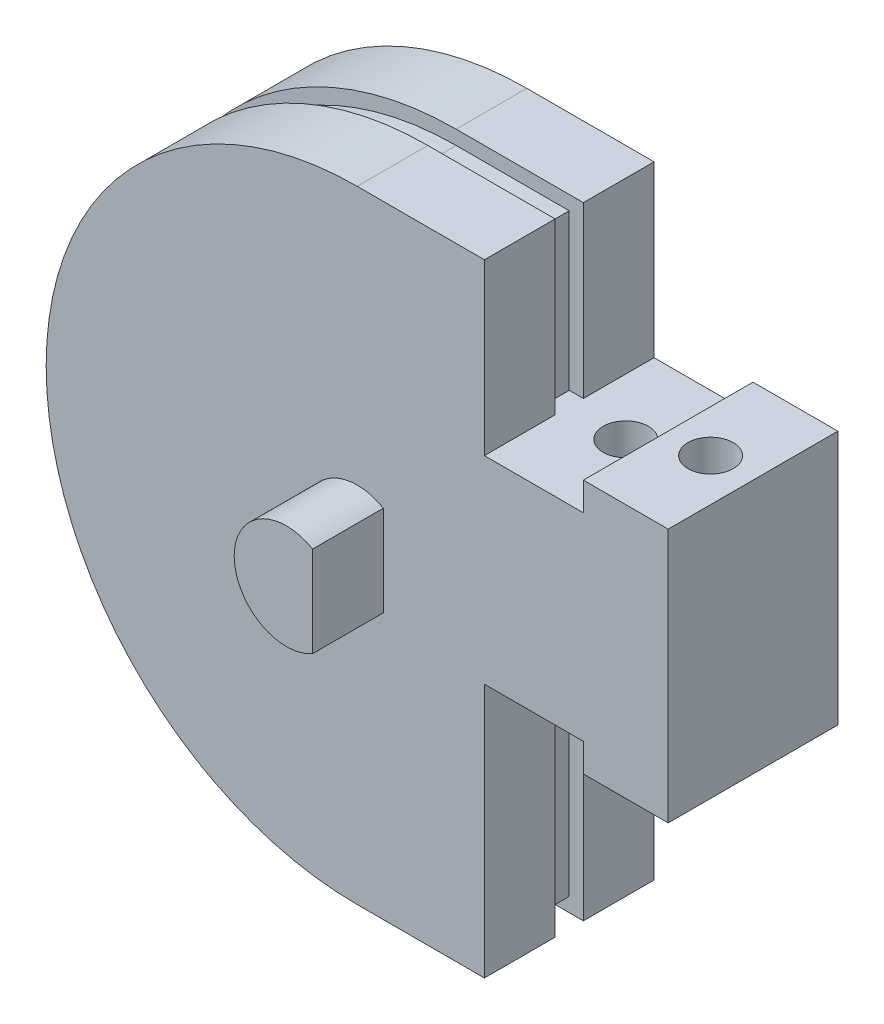
ISO-10303-21;
HEADER;
FILE_DESCRIPTION(('STEP AP214'),'2;1');
FILE_NAME('part.step','',(''),(''),'','','');
FILE_SCHEMA(('AUTOMOTIVE_DESIGN { 1 0 10303 214 1 1 1 1 }'));
ENDSEC;
DATA;
#1=APPLICATION_CONTEXT('core data for automotive mechanical design processes');
#2=APPLICATION_PROTOCOL_DEFINITION('international standard','automotive_design',2000,#1);
#3=PRODUCT_CONTEXT('',#1,'mechanical');
#4=PRODUCT('Part','Part','',(#3));
#5=PRODUCT_RELATED_PRODUCT_CATEGORY('part','',(#4));
#6=PRODUCT_DEFINITION_FORMATION('','',#4);
#7=PRODUCT_DEFINITION_CONTEXT('part definition',#1,'design');
#8=PRODUCT_DEFINITION('design','',#6,#7);
#9=PRODUCT_DEFINITION_SHAPE('','',#8);
#10=(LENGTH_UNIT() NAMED_UNIT(*) SI_UNIT(.MILLI.,.METRE.));
#11=(NAMED_UNIT(*) PLANE_ANGLE_UNIT() SI_UNIT($,.RADIAN.));
#12=(NAMED_UNIT(*) SI_UNIT($,.STERADIAN.) SOLID_ANGLE_UNIT());
#13=UNCERTAINTY_MEASURE_WITH_UNIT(LENGTH_MEASURE(1.E-05),#10,'distance_accuracy_value','');
#14=(GEOMETRIC_REPRESENTATION_CONTEXT(3) GLOBAL_UNCERTAINTY_ASSIGNED_CONTEXT((#13)) GLOBAL_UNIT_ASSIGNED_CONTEXT((#10,
#11,#12)) REPRESENTATION_CONTEXT('',''));
#15=CARTESIAN_POINT('',(0.,0.,0.));
#16=DIRECTION('',(0.,0.,1.));
#17=DIRECTION('',(1.,0.,0.));
#18=AXIS2_PLACEMENT_3D('',#15,#16,#17);
#19=CARTESIAN_POINT('',(0.,0.,0.));
#20=DIRECTION('',(0.,0.,1.));
#21=DIRECTION('',(1.,0.,0.));
#22=AXIS2_PLACEMENT_3D('',#19,#20,#21);
#23=PLANE('',#22);
#24=DIRECTION('',(-1.,0.,0.));
#25=VECTOR('',#24,1.);
#26=CARTESIAN_POINT('',(11.,6.,0.));
#27=LINE('',#26,#25);
#28=CARTESIAN_POINT('',(11.,6.,0.));
#29=VERTEX_POINT('',#28);
#30=CARTESIAN_POINT('',(8.,6.,0.));
#31=VERTEX_POINT('',#30);
#32=EDGE_CURVE('E309',#29,#31,#27,.T.);
#33=ORIENTED_EDGE('',*,*,#32,.F.);
#34=DIRECTION('',(0.,1.,0.));
#35=VECTOR('',#34,1.);
#36=CARTESIAN_POINT('',(11.,6.,0.));
#37=LINE('',#36,#35);
#38=CARTESIAN_POINT('',(11.,-3.,0.));
#39=VERTEX_POINT('',#38);
#40=EDGE_CURVE('E314',#39,#29,#37,.T.);
#41=ORIENTED_EDGE('',*,*,#40,.F.);
#42=DIRECTION('',(1.,0.,0.));
#43=VECTOR('',#42,1.);
#44=CARTESIAN_POINT('',(11.,-3.,0.));
#45=LINE('',#44,#43);
#46=CARTESIAN_POINT('',(8.,-3.,0.));
#47=VERTEX_POINT('',#46);
#48=EDGE_CURVE('E363',#47,#39,#45,.T.);
#49=ORIENTED_EDGE('',*,*,#48,.F.);
#50=DIRECTION('',(0.,-1.,0.));
#51=VECTOR('',#50,1.);
#52=CARTESIAN_POINT('',(8.,-3.,0.));
#53=LINE('',#52,#51);
#54=CARTESIAN_POINT('',(8.,-2.,0.));
#55=VERTEX_POINT('',#54);
#56=EDGE_CURVE('E361',#55,#47,#53,.T.);
#57=ORIENTED_EDGE('',*,*,#56,.F.);
#58=DIRECTION('',(1.,0.,0.));
#59=VECTOR('',#58,1.);
#60=CARTESIAN_POINT('',(8.,-2.,0.));
#61=LINE('',#60,#59);
#62=CARTESIAN_POINT('',(4.5,-2.,0.));
#63=VERTEX_POINT('',#62);
#64=EDGE_CURVE('E359',#63,#55,#61,.T.);
#65=ORIENTED_EDGE('',*,*,#64,.F.);
#66=DIRECTION('',(0.,1.,0.));
#67=VECTOR('',#66,1.);
#68=CARTESIAN_POINT('',(4.5,-2.,0.));
#69=LINE('',#68,#67);
#70=CARTESIAN_POINT('',(4.5,-11.,0.));
#71=VERTEX_POINT('',#70);
#72=EDGE_CURVE('E356',#71,#63,#69,.T.);
#73=ORIENTED_EDGE('',*,*,#72,.F.);
#74=DIRECTION('',(1.,0.,0.));
#75=VECTOR('',#74,1.);
#76=CARTESIAN_POINT('',(0.,-11.,0.));
#77=LINE('',#76,#75);
#78=CARTESIAN_POINT('',(0.,-11.,0.));
#79=VERTEX_POINT('',#78);
#80=EDGE_CURVE('E353',#79,#71,#77,.T.);
#81=ORIENTED_EDGE('',*,*,#80,.F.);
#82=CARTESIAN_POINT('',(0.,0.,0.));
#83=DIRECTION('',(0.,0.,1.));
#84=DIRECTION('',(1.,0.,0.));
#85=AXIS2_PLACEMENT_3D('',#82,#83,#84);
#86=CIRCLE('',#85,11.);
#87=CARTESIAN_POINT('',(0.,11.,0.));
#88=VERTEX_POINT('',#87);
#89=EDGE_CURVE('E350',#88,#79,#86,.T.);
#90=ORIENTED_EDGE('',*,*,#89,.F.);
#91=DIRECTION('',(-1.,0.,0.));
#92=VECTOR('',#91,1.);
#93=CARTESIAN_POINT('',(0.,11.,0.));
#94=LINE('',#93,#92);
#95=CARTESIAN_POINT('',(4.5,11.,0.));
#96=VERTEX_POINT('',#95);
#97=EDGE_CURVE('E347',#96,#88,#94,.T.);
#98=ORIENTED_EDGE('',*,*,#97,.F.);
#99=DIRECTION('',(0.,1.,0.));
#100=VECTOR('',#99,1.);
#101=CARTESIAN_POINT('',(4.5,5.,0.));
#102=LINE('',#101,#100);
#103=CARTESIAN_POINT('',(4.5,5.,0.));
#104=VERTEX_POINT('',#103);
#105=EDGE_CURVE('E344',#104,#96,#102,.T.);
#106=ORIENTED_EDGE('',*,*,#105,.F.);
#107=DIRECTION('',(-1.,0.,0.));
#108=VECTOR('',#107,1.);
#109=CARTESIAN_POINT('',(8.,5.,0.));
#110=LINE('',#109,#108);
#111=CARTESIAN_POINT('',(8.,5.,0.));
#112=VERTEX_POINT('',#111);
#113=EDGE_CURVE('E341',#112,#104,#110,.T.);
#114=ORIENTED_EDGE('',*,*,#113,.F.);
#115=DIRECTION('',(0.,-1.,0.));
#116=VECTOR('',#115,1.);
#117=CARTESIAN_POINT('',(8.,6.,0.));
#118=LINE('',#117,#116);
#119=EDGE_CURVE('E339',#31,#112,#118,.T.);
#120=ORIENTED_EDGE('',*,*,#119,.F.);
#121=EDGE_LOOP('',(#33,#41,#49,#57,#65,#73,#81,#90,#98,#106,#114,#120));
#122=FACE_BOUND('',#121,.T.);
#123=CARTESIAN_POINT('',(0.,0.,0.));
#124=DIRECTION('',(0.,0.,1.));
#125=DIRECTION('',(1.,0.,0.));
#126=AXIS2_PLACEMENT_3D('',#123,#124,#125);
#127=CIRCLE('',#126,2.75);
#128=CARTESIAN_POINT('',(2.75,0.,0.));
#129=VERTEX_POINT('',#128);
#130=EDGE_CURVE('E801',#129,#129,#127,.T.);
#131=ORIENTED_EDGE('',*,*,#130,.T.);
#132=EDGE_LOOP('',(#131));
#133=FACE_BOUND('',#132,.T.);
#134=ADVANCED_FACE('F35',(#122,#133),#23,.F.);
#135=CARTESIAN_POINT('',(0.,0.,6.));
#136=DIRECTION('',(0.,0.,1.));
#137=DIRECTION('',(1.,0.,0.));
#138=AXIS2_PLACEMENT_3D('',#135,#136,#137);
#139=PLANE('',#138);
#140=DIRECTION('',(-1.,0.,0.));
#141=VECTOR('',#140,1.);
#142=CARTESIAN_POINT('',(11.,6.,6.));
#143=LINE('',#142,#141);
#144=CARTESIAN_POINT('',(11.,6.,6.));
#145=VERTEX_POINT('',#144);
#146=CARTESIAN_POINT('',(8.,6.,6.));
#147=VERTEX_POINT('',#146);
#148=EDGE_CURVE('E310',#145,#147,#143,.T.);
#149=ORIENTED_EDGE('',*,*,#148,.T.);
#150=DIRECTION('',(0.,-1.,0.));
#151=VECTOR('',#150,1.);
#152=CARTESIAN_POINT('',(8.,6.,6.));
#153=LINE('',#152,#151);
#154=CARTESIAN_POINT('',(8.,5.,6.));
#155=VERTEX_POINT('',#154);
#156=EDGE_CURVE('E313',#147,#155,#153,.T.);
#157=ORIENTED_EDGE('',*,*,#156,.T.);
#158=DIRECTION('',(-1.,0.,0.));
#159=VECTOR('',#158,1.);
#160=CARTESIAN_POINT('',(8.,5.,6.));
#161=LINE('',#160,#159);
#162=CARTESIAN_POINT('',(4.5,5.,6.));
#163=VERTEX_POINT('',#162);
#164=EDGE_CURVE('E316',#155,#163,#161,.T.);
#165=ORIENTED_EDGE('',*,*,#164,.T.);
#166=DIRECTION('',(0.,1.,0.));
#167=VECTOR('',#166,1.);
#168=CARTESIAN_POINT('',(4.5,5.,6.));
#169=LINE('',#168,#167);
#170=CARTESIAN_POINT('',(4.5,11.,6.));
#171=VERTEX_POINT('',#170);
#172=EDGE_CURVE('E318',#163,#171,#169,.T.);
#173=ORIENTED_EDGE('',*,*,#172,.T.);
#174=DIRECTION('',(-1.,0.,0.));
#175=VECTOR('',#174,1.);
#176=CARTESIAN_POINT('',(0.,11.,6.));
#177=LINE('',#176,#175);
#178=CARTESIAN_POINT('',(0.,11.,6.));
#179=VERTEX_POINT('',#178);
#180=EDGE_CURVE('E320',#171,#179,#177,.T.);
#181=ORIENTED_EDGE('',*,*,#180,.T.);
#182=CARTESIAN_POINT('',(0.,0.,6.));
#183=DIRECTION('',(0.,0.,1.));
#184=DIRECTION('',(1.,0.,0.));
#185=AXIS2_PLACEMENT_3D('',#182,#183,#184);
#186=CIRCLE('',#185,11.);
#187=CARTESIAN_POINT('',(0.,-11.,6.));
#188=VERTEX_POINT('',#187);
#189=EDGE_CURVE('E322',#179,#188,#186,.T.);
#190=ORIENTED_EDGE('',*,*,#189,.T.);
#191=DIRECTION('',(1.,0.,0.));
#192=VECTOR('',#191,1.);
#193=CARTESIAN_POINT('',(0.,-11.,6.));
#194=LINE('',#193,#192);
#195=CARTESIAN_POINT('',(4.5,-11.,6.));
#196=VERTEX_POINT('',#195);
#197=EDGE_CURVE('E324',#188,#196,#194,.T.);
#198=ORIENTED_EDGE('',*,*,#197,.T.);
#199=DIRECTION('',(0.,1.,0.));
#200=VECTOR('',#199,1.);
#201=CARTESIAN_POINT('',(4.5,-2.,6.));
#202=LINE('',#201,#200);
#203=CARTESIAN_POINT('',(4.5,-2.,6.));
#204=VERTEX_POINT('',#203);
#205=EDGE_CURVE('E326',#196,#204,#202,.T.);
#206=ORIENTED_EDGE('',*,*,#205,.T.);
#207=DIRECTION('',(1.,0.,0.));
#208=VECTOR('',#207,1.);
#209=CARTESIAN_POINT('',(8.,-2.,6.));
#210=LINE('',#209,#208);
#211=CARTESIAN_POINT('',(8.,-2.,6.));
#212=VERTEX_POINT('',#211);
#213=EDGE_CURVE('E328',#204,#212,#210,.T.);
#214=ORIENTED_EDGE('',*,*,#213,.T.);
#215=DIRECTION('',(0.,-1.,0.));
#216=VECTOR('',#215,1.);
#217=CARTESIAN_POINT('',(8.,-3.,6.));
#218=LINE('',#217,#216);
#219=CARTESIAN_POINT('',(8.,-3.,6.));
#220=VERTEX_POINT('',#219);
#221=EDGE_CURVE('E330',#212,#220,#218,.T.);
#222=ORIENTED_EDGE('',*,*,#221,.T.);
#223=DIRECTION('',(1.,0.,0.));
#224=VECTOR('',#223,1.);
#225=CARTESIAN_POINT('',(11.,-3.,6.));
#226=LINE('',#225,#224);
#227=CARTESIAN_POINT('',(11.,-3.,6.));
#228=VERTEX_POINT('',#227);
#229=EDGE_CURVE('E332',#220,#228,#226,.T.);
#230=ORIENTED_EDGE('',*,*,#229,.T.);
#231=DIRECTION('',(0.,1.,0.));
#232=VECTOR('',#231,1.);
#233=CARTESIAN_POINT('',(11.,6.,6.));
#234=LINE('',#233,#232);
#235=EDGE_CURVE('E334',#228,#145,#234,.T.);
#236=ORIENTED_EDGE('',*,*,#235,.T.);
#237=EDGE_LOOP('',(#149,#157,#165,#173,#181,#190,#198,#206,#214,#222,#230,#236));
#238=FACE_BOUND('',#237,.T.);
#239=DIRECTION('',(0.,-1.,0.));
#240=VECTOR('',#239,1.);
#241=CARTESIAN_POINT('',(0.924999999999981,0.,6.));
#242=LINE('',#241,#240);
#243=CARTESIAN_POINT('',(0.924999999999981,1.6021469970012,6.));
#244=VERTEX_POINT('',#243);
#245=CARTESIAN_POINT('',(0.924999999999981,-1.6021469970012,6.));
#246=VERTEX_POINT('',#245);
#247=EDGE_CURVE('E51',#244,#246,#242,.T.);
#248=ORIENTED_EDGE('',*,*,#247,.T.);
#249=CARTESIAN_POINT('',(0.,0.,6.));
#250=DIRECTION('',(0.,0.,1.));
#251=DIRECTION('',(1.,0.,0.));
#252=AXIS2_PLACEMENT_3D('',#249,#250,#251);
#253=CIRCLE('',#252,1.84999999999998);
#254=EDGE_CURVE('E221',#244,#246,#253,.T.);
#255=ORIENTED_EDGE('',*,*,#254,.F.);
#256=EDGE_LOOP('',(#248,#255));
#257=FACE_BOUND('',#256,.T.);
#258=ADVANCED_FACE('F492',(#238,#257),#139,.T.);
#259=CARTESIAN_POINT('',(4.5,5.,6.));
#260=DIRECTION('',(-1.,0.,0.));
#261=DIRECTION('',(0.,0.,1.));
#262=AXIS2_PLACEMENT_3D('',#259,#260,#261);
#263=PLANE('',#262);
#264=DIRECTION('',(0.,1.,0.));
#265=VECTOR('',#264,1.);
#266=CARTESIAN_POINT('',(4.5,11.,2.5));
#267=LINE('',#266,#265);
#268=CARTESIAN_POINT('',(4.5,5.,2.5));
#269=VERTEX_POINT('',#268);
#270=CARTESIAN_POINT('',(4.5,11.,2.5));
#271=VERTEX_POINT('',#270);
#272=EDGE_CURVE('E283',#269,#271,#267,.T.);
#273=ORIENTED_EDGE('',*,*,#272,.F.);
#274=DIRECTION('',(0.,0.,-1.));
#275=VECTOR('',#274,1.);
#276=CARTESIAN_POINT('',(4.5,5.,6.));
#277=LINE('',#276,#275);
#278=EDGE_CURVE('E397',#269,#104,#277,.T.);
#279=ORIENTED_EDGE('',*,*,#278,.T.);
#280=ORIENTED_EDGE('',*,*,#105,.T.);
#281=DIRECTION('',(0.,0.,-1.));
#282=VECTOR('',#281,1.);
#283=CARTESIAN_POINT('',(4.5,11.,6.));
#284=LINE('',#283,#282);
#285=EDGE_CURVE('E393',#271,#96,#284,.T.);
#286=ORIENTED_EDGE('',*,*,#285,.F.);
#287=EDGE_LOOP('',(#273,#279,#280,#286));
#288=FACE_BOUND('',#287,.T.);
#289=ADVANCED_FACE('F435',(#288),#263,.F.);
#290=CARTESIAN_POINT('',(0.,11.,6.));
#291=DIRECTION('',(0.,-1.,0.));
#292=DIRECTION('',(0.,0.,-1.));
#293=AXIS2_PLACEMENT_3D('',#290,#291,#292);
#294=PLANE('',#293);
#295=DIRECTION('',(-1.,0.,0.));
#296=VECTOR('',#295,1.);
#297=CARTESIAN_POINT('',(0.,11.,2.5));
#298=LINE('',#297,#296);
#299=CARTESIAN_POINT('',(0.,11.,2.5));
#300=VERTEX_POINT('',#299);
#301=EDGE_CURVE('E238',#271,#300,#298,.T.);
#302=ORIENTED_EDGE('',*,*,#301,.F.);
#303=ORIENTED_EDGE('',*,*,#285,.T.);
#304=ORIENTED_EDGE('',*,*,#97,.T.);
#305=DIRECTION('',(0.,0.,-1.));
#306=VECTOR('',#305,1.);
#307=CARTESIAN_POINT('',(0.,11.,6.));
#308=LINE('',#307,#306);
#309=EDGE_CURVE('E389',#300,#88,#308,.T.);
#310=ORIENTED_EDGE('',*,*,#309,.F.);
#311=EDGE_LOOP('',(#302,#303,#304,#310));
#312=FACE_BOUND('',#311,.T.);
#313=ADVANCED_FACE('F442',(#312),#294,.F.);
#314=CARTESIAN_POINT('',(0.,0.,6.));
#315=DIRECTION('',(0.,0.,-1.));
#316=DIRECTION('',(-1.,0.,0.));
#317=AXIS2_PLACEMENT_3D('',#314,#315,#316);
#318=CYLINDRICAL_SURFACE('',#317,11.);
#319=CARTESIAN_POINT('',(0.,0.,2.5));
#320=DIRECTION('',(0.,0.,1.));
#321=DIRECTION('',(1.,0.,0.));
#322=AXIS2_PLACEMENT_3D('',#319,#320,#321);
#323=CIRCLE('',#322,11.);
#324=CARTESIAN_POINT('',(0.,-11.,2.5));
#325=VERTEX_POINT('',#324);
#326=EDGE_CURVE('E223',#300,#325,#323,.T.);
#327=ORIENTED_EDGE('',*,*,#326,.F.);
#328=ORIENTED_EDGE('',*,*,#309,.T.);
#329=ORIENTED_EDGE('',*,*,#89,.T.);
#330=DIRECTION('',(0.,0.,-1.));
#331=VECTOR('',#330,1.);
#332=CARTESIAN_POINT('',(0.,-11.,6.));
#333=LINE('',#332,#331);
#334=EDGE_CURVE('E385',#325,#79,#333,.T.);
#335=ORIENTED_EDGE('',*,*,#334,.F.);
#336=EDGE_LOOP('',(#327,#328,#329,#335));
#337=FACE_BOUND('',#336,.T.);
#338=ADVANCED_FACE('F444',(#337),#318,.T.);
#339=CARTESIAN_POINT('',(0.,-11.,6.));
#340=DIRECTION('',(0.,1.,0.));
#341=DIRECTION('',(0.,0.,1.));
#342=AXIS2_PLACEMENT_3D('',#339,#340,#341);
#343=PLANE('',#342);
#344=DIRECTION('',(1.,0.,0.));
#345=VECTOR('',#344,1.);
#346=CARTESIAN_POINT('',(0.,-11.,2.5));
#347=LINE('',#346,#345);
#348=CARTESIAN_POINT('',(4.5,-11.,2.5));
#349=VERTEX_POINT('',#348);
#350=EDGE_CURVE('E266',#325,#349,#347,.T.);
#351=ORIENTED_EDGE('',*,*,#350,.F.);
#352=ORIENTED_EDGE('',*,*,#334,.T.);
#353=ORIENTED_EDGE('',*,*,#80,.T.);
#354=DIRECTION('',(0.,0.,-1.));
#355=VECTOR('',#354,1.);
#356=CARTESIAN_POINT('',(4.5,-11.,6.));
#357=LINE('',#356,#355);
#358=EDGE_CURVE('E381',#349,#71,#357,.T.);
#359=ORIENTED_EDGE('',*,*,#358,.F.);
#360=EDGE_LOOP('',(#351,#352,#353,#359));
#361=FACE_BOUND('',#360,.T.);
#362=ADVANCED_FACE('F451',(#361),#343,.F.);
#363=CARTESIAN_POINT('',(4.5,-2.,6.));
#364=DIRECTION('',(-1.,0.,0.));
#365=DIRECTION('',(0.,0.,1.));
#366=AXIS2_PLACEMENT_3D('',#363,#364,#365);
#367=PLANE('',#366);
#368=DIRECTION('',(0.,1.,0.));
#369=VECTOR('',#368,1.);
#370=CARTESIAN_POINT('',(4.5,-11.,2.5));
#371=LINE('',#370,#369);
#372=CARTESIAN_POINT('',(4.5,-2.,2.5));
#373=VERTEX_POINT('',#372);
#374=EDGE_CURVE('E268',#349,#373,#371,.T.);
#375=ORIENTED_EDGE('',*,*,#374,.F.);
#376=ORIENTED_EDGE('',*,*,#358,.T.);
#377=ORIENTED_EDGE('',*,*,#72,.T.);
#378=DIRECTION('',(0.,0.,-1.));
#379=VECTOR('',#378,1.);
#380=CARTESIAN_POINT('',(4.5,-2.,6.));
#381=LINE('',#380,#379);
#382=EDGE_CURVE('E377',#373,#63,#381,.T.);
#383=ORIENTED_EDGE('',*,*,#382,.F.);
#384=EDGE_LOOP('',(#375,#376,#377,#383));
#385=FACE_BOUND('',#384,.T.);
#386=ADVANCED_FACE('F454',(#385),#367,.F.);
#387=CARTESIAN_POINT('',(11.,6.,6.));
#388=DIRECTION('',(0.,-1.,0.));
#389=DIRECTION('',(0.,0.,-1.));
#390=AXIS2_PLACEMENT_3D('',#387,#388,#389);
#391=PLANE('',#390);
#392=CARTESIAN_POINT('',(9.5,6.,3.));
#393=DIRECTION('',(0.,-1.,0.));
#394=DIRECTION('',(0.,0.,-1.));
#395=AXIS2_PLACEMENT_3D('',#392,#393,#394);
#396=CIRCLE('',#395,0.799999999999999);
#397=CARTESIAN_POINT('',(9.5,6.,2.2));
#398=VERTEX_POINT('',#397);
#399=EDGE_CURVE('E302',#398,#398,#396,.T.);
#400=ORIENTED_EDGE('',*,*,#399,.T.);
#401=EDGE_LOOP('',(#400));
#402=FACE_BOUND('',#401,.T.);
#403=ORIENTED_EDGE('',*,*,#32,.T.);
#404=DIRECTION('',(0.,0.,-1.));
#405=VECTOR('',#404,1.);
#406=CARTESIAN_POINT('',(8.,6.,6.));
#407=LINE('',#406,#405);
#408=EDGE_CURVE('E11',#147,#31,#407,.T.);
#409=ORIENTED_EDGE('',*,*,#408,.F.);
#410=ORIENTED_EDGE('',*,*,#148,.F.);
#411=DIRECTION('',(0.,0.,-1.));
#412=VECTOR('',#411,1.);
#413=CARTESIAN_POINT('',(11.,6.,6.));
#414=LINE('',#413,#412);
#415=EDGE_CURVE('E336',#145,#29,#414,.T.);
#416=ORIENTED_EDGE('',*,*,#415,.T.);
#417=EDGE_LOOP('',(#403,#409,#410,#416));
#418=FACE_BOUND('',#417,.T.);
#419=ADVANCED_FACE('F37',(#402,#418),#391,.F.);
#420=CARTESIAN_POINT('',(8.,6.,6.));
#421=DIRECTION('',(1.,0.,0.));
#422=DIRECTION('',(0.,0.,-1.));
#423=AXIS2_PLACEMENT_3D('',#420,#421,#422);
#424=PLANE('',#423);
#425=ORIENTED_EDGE('',*,*,#119,.T.);
#426=DIRECTION('',(0.,0.,-1.));
#427=VECTOR('',#426,1.);
#428=CARTESIAN_POINT('',(8.,5.,6.));
#429=LINE('',#428,#427);
#430=EDGE_CURVE('E44',#155,#112,#429,.T.);
#431=ORIENTED_EDGE('',*,*,#430,.F.);
#432=ORIENTED_EDGE('',*,*,#156,.F.);
#433=ORIENTED_EDGE('',*,*,#408,.T.);
#434=EDGE_LOOP('',(#425,#431,#432,#433));
#435=FACE_BOUND('',#434,.T.);
#436=ADVANCED_FACE('F419',(#435),#424,.F.);
#437=CARTESIAN_POINT('',(8.,5.,6.));
#438=DIRECTION('',(0.,-1.,0.));
#439=DIRECTION('',(0.,0.,-1.));
#440=AXIS2_PLACEMENT_3D('',#437,#438,#439);
#441=PLANE('',#440);
#442=CARTESIAN_POINT('',(6.5,5.,3.));
#443=DIRECTION('',(0.,-1.,0.));
#444=DIRECTION('',(0.,0.,-1.));
#445=AXIS2_PLACEMENT_3D('',#442,#443,#444);
#446=CIRCLE('',#445,0.8);
#447=CARTESIAN_POINT('',(6.5,5.,2.2));
#448=VERTEX_POINT('',#447);
#449=EDGE_CURVE('E306',#448,#448,#446,.T.);
#450=ORIENTED_EDGE('',*,*,#449,.T.);
#451=EDGE_LOOP('',(#450));
#452=FACE_BOUND('',#451,.T.);
#453=ORIENTED_EDGE('',*,*,#113,.T.);
#454=ORIENTED_EDGE('',*,*,#278,.F.);
#455=DIRECTION('',(1.,0.,0.));
#456=VECTOR('',#455,1.);
#457=CARTESIAN_POINT('',(4.5,5.,2.5));
#458=LINE('',#457,#456);
#459=CARTESIAN_POINT('',(4.,5.,2.5));
#460=VERTEX_POINT('',#459);
#461=EDGE_CURVE('E281',#460,#269,#458,.T.);
#462=ORIENTED_EDGE('',*,*,#461,.F.);
#463=DIRECTION('',(0.,0.,-1.));
#464=VECTOR('',#463,1.);
#465=CARTESIAN_POINT('',(4.,5.,3.5));
#466=LINE('',#465,#464);
#467=CARTESIAN_POINT('',(4.,5.,3.5));
#468=VERTEX_POINT('',#467);
#469=EDGE_CURVE('E264',#468,#460,#466,.T.);
#470=ORIENTED_EDGE('',*,*,#469,.F.);
#471=DIRECTION('',(1.,0.,0.));
#472=VECTOR('',#471,1.);
#473=CARTESIAN_POINT('',(4.5,5.,3.5));
#474=LINE('',#473,#472);
#475=CARTESIAN_POINT('',(4.5,5.,3.5));
#476=VERTEX_POINT('',#475);
#477=EDGE_CURVE('E256',#468,#476,#474,.T.);
#478=ORIENTED_EDGE('',*,*,#477,.T.);
#479=EDGE_CURVE('E398',#163,#476,#277,.T.);
#480=ORIENTED_EDGE('',*,*,#479,.F.);
#481=ORIENTED_EDGE('',*,*,#164,.F.);
#482=ORIENTED_EDGE('',*,*,#430,.T.);
#483=EDGE_LOOP('',(#453,#454,#462,#470,#478,#480,#481,#482));
#484=FACE_BOUND('',#483,.T.);
#485=ADVANCED_FACE('F415',(#452,#484),#441,.F.);
#486=ORIENTED_EDGE('',*,*,#479,.T.);
#487=DIRECTION('',(0.,1.,0.));
#488=VECTOR('',#487,1.);
#489=CARTESIAN_POINT('',(4.5,11.,3.5));
#490=LINE('',#489,#488);
#491=CARTESIAN_POINT('',(4.5,11.,3.5));
#492=VERTEX_POINT('',#491);
#493=EDGE_CURVE('E258',#476,#492,#490,.T.);
#494=ORIENTED_EDGE('',*,*,#493,.T.);
#495=EDGE_CURVE('E394',#171,#492,#284,.T.);
#496=ORIENTED_EDGE('',*,*,#495,.F.);
#497=ORIENTED_EDGE('',*,*,#172,.F.);
#498=EDGE_LOOP('',(#486,#494,#496,#497));
#499=FACE_BOUND('',#498,.T.);
#500=ADVANCED_FACE('F418',(#499),#263,.F.);
#501=ORIENTED_EDGE('',*,*,#495,.T.);
#502=DIRECTION('',(-1.,0.,0.));
#503=VECTOR('',#502,1.);
#504=CARTESIAN_POINT('',(0.,11.,3.5));
#505=LINE('',#504,#503);
#506=CARTESIAN_POINT('',(0.,11.,3.5));
#507=VERTEX_POINT('',#506);
#508=EDGE_CURVE('E261',#492,#507,#505,.T.);
#509=ORIENTED_EDGE('',*,*,#508,.T.);
#510=EDGE_CURVE('E390',#179,#507,#308,.T.);
#511=ORIENTED_EDGE('',*,*,#510,.F.);
#512=ORIENTED_EDGE('',*,*,#180,.F.);
#513=EDGE_LOOP('',(#501,#509,#511,#512));
#514=FACE_BOUND('',#513,.T.);
#515=ADVANCED_FACE('F527',(#514),#294,.F.);
#516=ORIENTED_EDGE('',*,*,#510,.T.);
#517=CARTESIAN_POINT('',(0.,0.,3.5));
#518=DIRECTION('',(0.,0.,1.));
#519=DIRECTION('',(1.,0.,0.));
#520=AXIS2_PLACEMENT_3D('',#517,#518,#519);
#521=CIRCLE('',#520,11.);
#522=CARTESIAN_POINT('',(0.,-11.,3.5));
#523=VERTEX_POINT('',#522);
#524=EDGE_CURVE('E234',#507,#523,#521,.T.);
#525=ORIENTED_EDGE('',*,*,#524,.T.);
#526=EDGE_CURVE('E386',#188,#523,#333,.T.);
#527=ORIENTED_EDGE('',*,*,#526,.F.);
#528=ORIENTED_EDGE('',*,*,#189,.F.);
#529=EDGE_LOOP('',(#516,#525,#527,#528));
#530=FACE_BOUND('',#529,.T.);
#531=ADVANCED_FACE('F524',(#530),#318,.T.);
#532=ORIENTED_EDGE('',*,*,#526,.T.);
#533=DIRECTION('',(1.,0.,0.));
#534=VECTOR('',#533,1.);
#535=CARTESIAN_POINT('',(0.,-11.,3.5));
#536=LINE('',#535,#534);
#537=CARTESIAN_POINT('',(4.5,-11.,3.5));
#538=VERTEX_POINT('',#537);
#539=EDGE_CURVE('E237',#523,#538,#536,.T.);
#540=ORIENTED_EDGE('',*,*,#539,.T.);
#541=EDGE_CURVE('E382',#196,#538,#357,.T.);
#542=ORIENTED_EDGE('',*,*,#541,.F.);
#543=ORIENTED_EDGE('',*,*,#197,.F.);
#544=EDGE_LOOP('',(#532,#540,#542,#543));
#545=FACE_BOUND('',#544,.T.);
#546=ADVANCED_FACE('F520',(#545),#343,.F.);
#547=ORIENTED_EDGE('',*,*,#541,.T.);
#548=DIRECTION('',(0.,1.,0.));
#549=VECTOR('',#548,1.);
#550=CARTESIAN_POINT('',(4.5,-11.,3.5));
#551=LINE('',#550,#549);
#552=CARTESIAN_POINT('',(4.5,-2.,3.5));
#553=VERTEX_POINT('',#552);
#554=EDGE_CURVE('E241',#538,#553,#551,.T.);
#555=ORIENTED_EDGE('',*,*,#554,.T.);
#556=EDGE_CURVE('E378',#204,#553,#381,.T.);
#557=ORIENTED_EDGE('',*,*,#556,.F.);
#558=ORIENTED_EDGE('',*,*,#205,.F.);
#559=EDGE_LOOP('',(#547,#555,#557,#558));
#560=FACE_BOUND('',#559,.T.);
#561=ADVANCED_FACE('F518',(#560),#367,.F.);
#562=CARTESIAN_POINT('',(8.,-2.,6.));
#563=DIRECTION('',(0.,1.,0.));
#564=DIRECTION('',(0.,0.,1.));
#565=AXIS2_PLACEMENT_3D('',#562,#563,#564);
#566=PLANE('',#565);
#567=CARTESIAN_POINT('',(6.5,-2.,3.));
#568=DIRECTION('',(0.,1.,0.));
#569=DIRECTION('',(0.,0.,1.));
#570=AXIS2_PLACEMENT_3D('',#567,#568,#569);
#571=CIRCLE('',#570,0.8);
#572=CARTESIAN_POINT('',(6.5,-2.,3.8));
#573=VERTEX_POINT('',#572);
#574=EDGE_CURVE('E305',#573,#573,#571,.T.);
#575=ORIENTED_EDGE('',*,*,#574,.T.);
#576=EDGE_LOOP('',(#575));
#577=FACE_BOUND('',#576,.T.);
#578=ORIENTED_EDGE('',*,*,#64,.T.);
#579=DIRECTION('',(0.,0.,-1.));
#580=VECTOR('',#579,1.);
#581=CARTESIAN_POINT('',(8.,-2.,6.));
#582=LINE('',#581,#580);
#583=EDGE_CURVE('E374',#212,#55,#582,.T.);
#584=ORIENTED_EDGE('',*,*,#583,.F.);
#585=ORIENTED_EDGE('',*,*,#213,.F.);
#586=ORIENTED_EDGE('',*,*,#556,.T.);
#587=DIRECTION('',(-1.,0.,0.));
#588=VECTOR('',#587,1.);
#589=CARTESIAN_POINT('',(4.5,-2.,3.5));
#590=LINE('',#589,#588);
#591=CARTESIAN_POINT('',(4.,-2.,3.5));
#592=VERTEX_POINT('',#591);
#593=EDGE_CURVE('E244',#553,#592,#590,.T.);
#594=ORIENTED_EDGE('',*,*,#593,.T.);
#595=DIRECTION('',(0.,0.,-1.));
#596=VECTOR('',#595,1.);
#597=CARTESIAN_POINT('',(4.,-2.,3.5));
#598=LINE('',#597,#596);
#599=CARTESIAN_POINT('',(4.,-2.,2.5));
#600=VERTEX_POINT('',#599);
#601=EDGE_CURVE('E300',#592,#600,#598,.T.);
#602=ORIENTED_EDGE('',*,*,#601,.T.);
#603=DIRECTION('',(-1.,0.,0.));
#604=VECTOR('',#603,1.);
#605=CARTESIAN_POINT('',(4.5,-2.,2.5));
#606=LINE('',#605,#604);
#607=EDGE_CURVE('E59',#373,#600,#606,.T.);
#608=ORIENTED_EDGE('',*,*,#607,.F.);
#609=ORIENTED_EDGE('',*,*,#382,.T.);
#610=EDGE_LOOP('',(#578,#584,#585,#586,#594,#602,#608,#609));
#611=FACE_BOUND('',#610,.T.);
#612=ADVANCED_FACE('F405',(#577,#611),#566,.F.);
#613=CARTESIAN_POINT('',(8.,-3.,6.));
#614=DIRECTION('',(1.,0.,0.));
#615=DIRECTION('',(0.,0.,-1.));
#616=AXIS2_PLACEMENT_3D('',#613,#614,#615);
#617=PLANE('',#616);
#618=ORIENTED_EDGE('',*,*,#56,.T.);
#619=DIRECTION('',(0.,0.,-1.));
#620=VECTOR('',#619,1.);
#621=CARTESIAN_POINT('',(8.,-3.,6.));
#622=LINE('',#621,#620);
#623=EDGE_CURVE('E371',#220,#47,#622,.T.);
#624=ORIENTED_EDGE('',*,*,#623,.F.);
#625=ORIENTED_EDGE('',*,*,#221,.F.);
#626=ORIENTED_EDGE('',*,*,#583,.T.);
#627=EDGE_LOOP('',(#618,#624,#625,#626));
#628=FACE_BOUND('',#627,.T.);
#629=ADVANCED_FACE('F509',(#628),#617,.F.);
#630=CARTESIAN_POINT('',(11.,-3.,6.));
#631=DIRECTION('',(0.,1.,0.));
#632=DIRECTION('',(0.,0.,1.));
#633=AXIS2_PLACEMENT_3D('',#630,#631,#632);
#634=PLANE('',#633);
#635=CARTESIAN_POINT('',(9.5,-3.,3.));
#636=DIRECTION('',(0.,1.,0.));
#637=DIRECTION('',(0.,0.,1.));
#638=AXIS2_PLACEMENT_3D('',#635,#636,#637);
#639=CIRCLE('',#638,0.799999999999999);
#640=CARTESIAN_POINT('',(9.5,-3.,3.8));
#641=VERTEX_POINT('',#640);
#642=EDGE_CURVE('E39',#641,#641,#639,.T.);
#643=ORIENTED_EDGE('',*,*,#642,.T.);
#644=EDGE_LOOP('',(#643));
#645=FACE_BOUND('',#644,.T.);
#646=ORIENTED_EDGE('',*,*,#48,.T.);
#647=DIRECTION('',(0.,0.,-1.));
#648=VECTOR('',#647,1.);
#649=CARTESIAN_POINT('',(11.,-3.,6.));
#650=LINE('',#649,#648);
#651=EDGE_CURVE('E368',#228,#39,#650,.T.);
#652=ORIENTED_EDGE('',*,*,#651,.F.);
#653=ORIENTED_EDGE('',*,*,#229,.F.);
#654=ORIENTED_EDGE('',*,*,#623,.T.);
#655=EDGE_LOOP('',(#646,#652,#653,#654));
#656=FACE_BOUND('',#655,.T.);
#657=ADVANCED_FACE('F505',(#645,#656),#634,.F.);
#658=CARTESIAN_POINT('',(11.,6.,6.));
#659=DIRECTION('',(-1.,0.,0.));
#660=DIRECTION('',(0.,0.,1.));
#661=AXIS2_PLACEMENT_3D('',#658,#659,#660);
#662=PLANE('',#661);
#663=ORIENTED_EDGE('',*,*,#40,.T.);
#664=ORIENTED_EDGE('',*,*,#415,.F.);
#665=ORIENTED_EDGE('',*,*,#235,.F.);
#666=ORIENTED_EDGE('',*,*,#651,.T.);
#667=EDGE_LOOP('',(#663,#664,#665,#666));
#668=FACE_BOUND('',#667,.T.);
#669=ADVANCED_FACE('F411',(#668),#662,.F.);
#670=CARTESIAN_POINT('',(6.5,-11.,3.));
#671=DIRECTION('',(0.,1.,0.));
#672=DIRECTION('',(0.,0.,1.));
#673=AXIS2_PLACEMENT_3D('',#670,#671,#672);
#674=CYLINDRICAL_SURFACE('',#673,0.8);
#675=ORIENTED_EDGE('',*,*,#574,.F.);
#676=EDGE_LOOP('',(#675));
#677=FACE_BOUND('',#676,.T.);
#678=ORIENTED_EDGE('',*,*,#449,.F.);
#679=EDGE_LOOP('',(#678));
#680=FACE_BOUND('',#679,.T.);
#681=ADVANCED_FACE('F407',(#677,#680),#674,.F.);
#682=CARTESIAN_POINT('',(9.5,-11.,3.));
#683=DIRECTION('',(0.,1.,0.));
#684=DIRECTION('',(0.,0.,1.));
#685=AXIS2_PLACEMENT_3D('',#682,#683,#684);
#686=CYLINDRICAL_SURFACE('',#685,0.799999999999999);
#687=ORIENTED_EDGE('',*,*,#642,.F.);
#688=EDGE_LOOP('',(#687));
#689=FACE_BOUND('',#688,.T.);
#690=ORIENTED_EDGE('',*,*,#399,.F.);
#691=EDGE_LOOP('',(#690));
#692=FACE_BOUND('',#691,.T.);
#693=ADVANCED_FACE('F410',(#689,#692),#686,.F.);
#694=CARTESIAN_POINT('',(4.,-10.5,3.5));
#695=DIRECTION('',(1.,0.,0.));
#696=DIRECTION('',(0.,0.,-1.));
#697=AXIS2_PLACEMENT_3D('',#694,#695,#696);
#698=PLANE('',#697);
#699=DIRECTION('',(0.,-1.,0.));
#700=VECTOR('',#699,1.);
#701=CARTESIAN_POINT('',(4.,-10.5,2.5));
#702=LINE('',#701,#700);
#703=CARTESIAN_POINT('',(4.,-10.5,2.5));
#704=VERTEX_POINT('',#703);
#705=EDGE_CURVE('E271',#600,#704,#702,.T.);
#706=ORIENTED_EDGE('',*,*,#705,.F.);
#707=ORIENTED_EDGE('',*,*,#601,.F.);
#708=DIRECTION('',(0.,-1.,0.));
#709=VECTOR('',#708,1.);
#710=CARTESIAN_POINT('',(4.,-10.5,3.5));
#711=LINE('',#710,#709);
#712=CARTESIAN_POINT('',(4.,-10.5,3.5));
#713=VERTEX_POINT('',#712);
#714=EDGE_CURVE('E246',#592,#713,#711,.T.);
#715=ORIENTED_EDGE('',*,*,#714,.T.);
#716=DIRECTION('',(0.,0.,-1.));
#717=VECTOR('',#716,1.);
#718=CARTESIAN_POINT('',(4.,-10.5,3.5));
#719=LINE('',#718,#717);
#720=EDGE_CURVE('E297',#713,#704,#719,.T.);
#721=ORIENTED_EDGE('',*,*,#720,.T.);
#722=EDGE_LOOP('',(#706,#707,#715,#721));
#723=FACE_BOUND('',#722,.T.);
#724=ADVANCED_FACE('F461',(#723),#698,.T.);
#725=CARTESIAN_POINT('',(0.,-10.5,3.5));
#726=DIRECTION('',(0.,-1.,0.));
#727=DIRECTION('',(0.,0.,-1.));
#728=AXIS2_PLACEMENT_3D('',#725,#726,#727);
#729=PLANE('',#728);
#730=DIRECTION('',(-1.,0.,0.));
#731=VECTOR('',#730,1.);
#732=CARTESIAN_POINT('',(0.,-10.5,2.5));
#733=LINE('',#732,#731);
#734=CARTESIAN_POINT('',(0.,-10.5,2.5));
#735=VERTEX_POINT('',#734);
#736=EDGE_CURVE('E273',#704,#735,#733,.T.);
#737=ORIENTED_EDGE('',*,*,#736,.F.);
#738=ORIENTED_EDGE('',*,*,#720,.F.);
#739=DIRECTION('',(-1.,0.,0.));
#740=VECTOR('',#739,1.);
#741=CARTESIAN_POINT('',(0.,-10.5,3.5));
#742=LINE('',#741,#740);
#743=CARTESIAN_POINT('',(0.,-10.5,3.5));
#744=VERTEX_POINT('',#743);
#745=EDGE_CURVE('E248',#713,#744,#742,.T.);
#746=ORIENTED_EDGE('',*,*,#745,.T.);
#747=DIRECTION('',(0.,0.,-1.));
#748=VECTOR('',#747,1.);
#749=CARTESIAN_POINT('',(0.,-10.5,3.5));
#750=LINE('',#749,#748);
#751=EDGE_CURVE('E294',#744,#735,#750,.T.);
#752=ORIENTED_EDGE('',*,*,#751,.T.);
#753=EDGE_LOOP('',(#737,#738,#746,#752));
#754=FACE_BOUND('',#753,.T.);
#755=ADVANCED_FACE('F466',(#754),#729,.T.);
#756=CARTESIAN_POINT('',(0.,0.,3.5));
#757=DIRECTION('',(0.,0.,-1.));
#758=DIRECTION('',(-1.,0.,0.));
#759=AXIS2_PLACEMENT_3D('',#756,#757,#758);
#760=CYLINDRICAL_SURFACE('',#759,10.5);
#761=CARTESIAN_POINT('',(0.,0.,2.5));
#762=DIRECTION('',(0.,0.,-1.));
#763=DIRECTION('',(1.,0.,0.));
#764=AXIS2_PLACEMENT_3D('',#761,#762,#763);
#765=CIRCLE('',#764,10.5);
#766=CARTESIAN_POINT('',(0.,10.5,2.5));
#767=VERTEX_POINT('',#766);
#768=EDGE_CURVE('E275',#735,#767,#765,.T.);
#769=ORIENTED_EDGE('',*,*,#768,.F.);
#770=ORIENTED_EDGE('',*,*,#751,.F.);
#771=CARTESIAN_POINT('',(0.,0.,3.5));
#772=DIRECTION('',(0.,0.,-1.));
#773=DIRECTION('',(1.,0.,0.));
#774=AXIS2_PLACEMENT_3D('',#771,#772,#773);
#775=CIRCLE('',#774,10.5);
#776=CARTESIAN_POINT('',(0.,10.5,3.5));
#777=VERTEX_POINT('',#776);
#778=EDGE_CURVE('E250',#744,#777,#775,.T.);
#779=ORIENTED_EDGE('',*,*,#778,.T.);
#780=DIRECTION('',(0.,0.,-1.));
#781=VECTOR('',#780,1.);
#782=CARTESIAN_POINT('',(0.,10.5,3.5));
#783=LINE('',#782,#781);
#784=EDGE_CURVE('E291',#777,#767,#783,.T.);
#785=ORIENTED_EDGE('',*,*,#784,.T.);
#786=EDGE_LOOP('',(#769,#770,#779,#785));
#787=FACE_BOUND('',#786,.T.);
#788=ADVANCED_FACE('F472',(#787),#760,.T.);
#789=CARTESIAN_POINT('',(0.,10.5,3.5));
#790=DIRECTION('',(0.,1.,0.));
#791=DIRECTION('',(0.,0.,1.));
#792=AXIS2_PLACEMENT_3D('',#789,#790,#791);
#793=PLANE('',#792);
#794=DIRECTION('',(1.,0.,0.));
#795=VECTOR('',#794,1.);
#796=CARTESIAN_POINT('',(0.,10.5,2.5));
#797=LINE('',#796,#795);
#798=CARTESIAN_POINT('',(4.,10.5,2.5));
#799=VERTEX_POINT('',#798);
#800=EDGE_CURVE('E277',#767,#799,#797,.T.);
#801=ORIENTED_EDGE('',*,*,#800,.F.);
#802=ORIENTED_EDGE('',*,*,#784,.F.);
#803=DIRECTION('',(1.,0.,0.));
#804=VECTOR('',#803,1.);
#805=CARTESIAN_POINT('',(0.,10.5,3.5));
#806=LINE('',#805,#804);
#807=CARTESIAN_POINT('',(4.,10.5,3.5));
#808=VERTEX_POINT('',#807);
#809=EDGE_CURVE('E252',#777,#808,#806,.T.);
#810=ORIENTED_EDGE('',*,*,#809,.T.);
#811=DIRECTION('',(0.,0.,-1.));
#812=VECTOR('',#811,1.);
#813=CARTESIAN_POINT('',(4.,10.5,3.5));
#814=LINE('',#813,#812);
#815=EDGE_CURVE('E288',#808,#799,#814,.T.);
#816=ORIENTED_EDGE('',*,*,#815,.T.);
#817=EDGE_LOOP('',(#801,#802,#810,#816));
#818=FACE_BOUND('',#817,.T.);
#819=ADVANCED_FACE('F476',(#818),#793,.T.);
#820=CARTESIAN_POINT('',(4.,10.5,3.5));
#821=DIRECTION('',(1.,0.,0.));
#822=DIRECTION('',(0.,0.,-1.));
#823=AXIS2_PLACEMENT_3D('',#820,#821,#822);
#824=PLANE('',#823);
#825=DIRECTION('',(0.,-1.,0.));
#826=VECTOR('',#825,1.);
#827=CARTESIAN_POINT('',(4.,10.5,2.5));
#828=LINE('',#827,#826);
#829=EDGE_CURVE('E279',#799,#460,#828,.T.);
#830=ORIENTED_EDGE('',*,*,#829,.F.);
#831=ORIENTED_EDGE('',*,*,#815,.F.);
#832=DIRECTION('',(0.,-1.,0.));
#833=VECTOR('',#832,1.);
#834=CARTESIAN_POINT('',(4.,10.5,3.5));
#835=LINE('',#834,#833);
#836=EDGE_CURVE('E254',#808,#468,#835,.T.);
#837=ORIENTED_EDGE('',*,*,#836,.T.);
#838=ORIENTED_EDGE('',*,*,#469,.T.);
#839=EDGE_LOOP('',(#830,#831,#837,#838));
#840=FACE_BOUND('',#839,.T.);
#841=ADVANCED_FACE('F481',(#840),#824,.T.);
#842=CARTESIAN_POINT('',(0.,0.,3.5));
#843=DIRECTION('',(0.,0.,1.));
#844=DIRECTION('',(1.,0.,0.));
#845=AXIS2_PLACEMENT_3D('',#842,#843,#844);
#846=PLANE('',#845);
#847=ORIENTED_EDGE('',*,*,#524,.F.);
#848=ORIENTED_EDGE('',*,*,#508,.F.);
#849=ORIENTED_EDGE('',*,*,#493,.F.);
#850=ORIENTED_EDGE('',*,*,#477,.F.);
#851=ORIENTED_EDGE('',*,*,#836,.F.);
#852=ORIENTED_EDGE('',*,*,#809,.F.);
#853=ORIENTED_EDGE('',*,*,#778,.F.);
#854=ORIENTED_EDGE('',*,*,#745,.F.);
#855=ORIENTED_EDGE('',*,*,#714,.F.);
#856=ORIENTED_EDGE('',*,*,#593,.F.);
#857=ORIENTED_EDGE('',*,*,#554,.F.);
#858=ORIENTED_EDGE('',*,*,#539,.F.);
#859=EDGE_LOOP('',(#847,#848,#849,#850,#851,#852,#853,#854,#855,#856,#857,#858));
#860=FACE_BOUND('',#859,.T.);
#861=ADVANCED_FACE('F487',(#860),#846,.F.);
#862=CARTESIAN_POINT('',(0.,0.,2.5));
#863=DIRECTION('',(0.,0.,1.));
#864=DIRECTION('',(1.,0.,0.));
#865=AXIS2_PLACEMENT_3D('',#862,#863,#864);
#866=PLANE('',#865);
#867=ORIENTED_EDGE('',*,*,#326,.T.);
#868=ORIENTED_EDGE('',*,*,#350,.T.);
#869=ORIENTED_EDGE('',*,*,#374,.T.);
#870=ORIENTED_EDGE('',*,*,#607,.T.);
#871=ORIENTED_EDGE('',*,*,#705,.T.);
#872=ORIENTED_EDGE('',*,*,#736,.T.);
#873=ORIENTED_EDGE('',*,*,#768,.T.);
#874=ORIENTED_EDGE('',*,*,#800,.T.);
#875=ORIENTED_EDGE('',*,*,#829,.T.);
#876=ORIENTED_EDGE('',*,*,#461,.T.);
#877=ORIENTED_EDGE('',*,*,#272,.T.);
#878=ORIENTED_EDGE('',*,*,#301,.T.);
#879=EDGE_LOOP('',(#867,#868,#869,#870,#871,#872,#873,#874,#875,#876,#877,#878));
#880=FACE_BOUND('',#879,.T.);
#881=ADVANCED_FACE('F438',(#880),#866,.T.);
#882=CARTESIAN_POINT('',(0.,0.,8.5));
#883=DIRECTION('',(0.,0.,-1.));
#884=DIRECTION('',(-1.,0.,0.));
#885=AXIS2_PLACEMENT_3D('',#882,#883,#884);
#886=CYLINDRICAL_SURFACE('',#885,1.84999999999998);
#887=ORIENTED_EDGE('',*,*,#254,.T.);
#888=DIRECTION('',(0.,0.,-1.));
#889=VECTOR('',#888,1.);
#890=CARTESIAN_POINT('',(0.924999999999981,-1.6021469970012,8.5));
#891=LINE('',#890,#889);
#892=CARTESIAN_POINT('',(0.924999999999981,-1.6021469970012,8.5));
#893=VERTEX_POINT('',#892);
#894=EDGE_CURVE('E219',#893,#246,#891,.T.);
#895=ORIENTED_EDGE('',*,*,#894,.F.);
#896=CARTESIAN_POINT('',(0.,0.,8.5));
#897=DIRECTION('',(0.,0.,1.));
#898=DIRECTION('',(1.,0.,0.));
#899=AXIS2_PLACEMENT_3D('',#896,#897,#898);
#900=CIRCLE('',#899,1.84999999999998);
#901=CARTESIAN_POINT('',(0.924999999999981,1.6021469970012,8.5));
#902=VERTEX_POINT('',#901);
#903=EDGE_CURVE('E210',#902,#893,#900,.T.);
#904=ORIENTED_EDGE('',*,*,#903,.F.);
#905=DIRECTION('',(0.,0.,-1.));
#906=VECTOR('',#905,1.);
#907=CARTESIAN_POINT('',(0.924999999999981,1.6021469970012,8.5));
#908=LINE('',#907,#906);
#909=EDGE_CURVE('E224',#902,#244,#908,.T.);
#910=ORIENTED_EDGE('',*,*,#909,.T.);
#911=EDGE_LOOP('',(#887,#895,#904,#910));
#912=FACE_BOUND('',#911,.T.);
#913=ADVANCED_FACE('F220',(#912),#886,.T.);
#914=CARTESIAN_POINT('',(0.924999999999981,0.,8.5));
#915=DIRECTION('',(1.,0.,0.));
#916=DIRECTION('',(0.,0.,-1.));
#917=AXIS2_PLACEMENT_3D('',#914,#915,#916);
#918=PLANE('',#917);
#919=ORIENTED_EDGE('',*,*,#247,.F.);
#920=ORIENTED_EDGE('',*,*,#909,.F.);
#921=DIRECTION('',(0.,-1.,0.));
#922=VECTOR('',#921,1.);
#923=CARTESIAN_POINT('',(0.924999999999981,0.,8.5));
#924=LINE('',#923,#922);
#925=EDGE_CURVE('E214',#902,#893,#924,.T.);
#926=ORIENTED_EDGE('',*,*,#925,.T.);
#927=ORIENTED_EDGE('',*,*,#894,.T.);
#928=EDGE_LOOP('',(#919,#920,#926,#927));
#929=FACE_BOUND('',#928,.T.);
#930=ADVANCED_FACE('F226',(#929),#918,.T.);
#931=CARTESIAN_POINT('',(0.,0.,8.5));
#932=DIRECTION('',(0.,0.,1.));
#933=DIRECTION('',(1.,0.,0.));
#934=AXIS2_PLACEMENT_3D('',#931,#932,#933);
#935=PLANE('',#934);
#936=ORIENTED_EDGE('',*,*,#903,.T.);
#937=ORIENTED_EDGE('',*,*,#925,.F.);
#938=EDGE_LOOP('',(#936,#937));
#939=FACE_BOUND('',#938,.T.);
#940=ADVANCED_FACE('F212',(#939),#935,.T.);
#941=CARTESIAN_POINT('',(0.,0.,3.5));
#942=DIRECTION('',(0.,0.,-1.));
#943=DIRECTION('',(-1.,0.,0.));
#944=AXIS2_PLACEMENT_3D('',#941,#942,#943);
#945=CYLINDRICAL_SURFACE('',#944,2.75);
#946=CARTESIAN_POINT('',(0.,0.,3.5));
#947=DIRECTION('',(0.,0.,1.));
#948=DIRECTION('',(1.,0.,0.));
#949=AXIS2_PLACEMENT_3D('',#946,#947,#948);
#950=CIRCLE('',#949,2.75);
#951=CARTESIAN_POINT('',(2.75,0.,3.5));
#952=VERTEX_POINT('',#951);
#953=EDGE_CURVE('E232',#952,#952,#950,.T.);
#954=ORIENTED_EDGE('',*,*,#953,.T.);
#955=EDGE_LOOP('',(#954));
#956=FACE_BOUND('',#955,.T.);
#957=ORIENTED_EDGE('',*,*,#130,.F.);
#958=EDGE_LOOP('',(#957));
#959=FACE_BOUND('',#958,.T.);
#960=ADVANCED_FACE('F609',(#956,#959),#945,.F.);
#961=CARTESIAN_POINT('',(0.,0.,3.5));
#962=DIRECTION('',(0.,0.,1.));
#963=DIRECTION('',(1.,0.,0.));
#964=AXIS2_PLACEMENT_3D('',#961,#962,#963);
#965=PLANE('',#964);
#966=ORIENTED_EDGE('',*,*,#953,.F.);
#967=EDGE_LOOP('',(#966));
#968=FACE_BOUND('',#967,.T.);
#969=ADVANCED_FACE('F623',(#968),#965,.F.);
#970=CLOSED_SHELL('',(#134,#258,#289,#313,#338,#362,#386,#419,#436,#485,#500,#515,#531,#546,
#561,#612,#629,#657,#669,#681,#693,#724,#755,#788,#819,#841,#861,#881,#913,#930,#940,#960,#969));
#971=MANIFOLD_SOLID_BREP('B2',#970);
#972=ADVANCED_BREP_SHAPE_REPRESENTATION('',(#18,#971),#14);
#973=SHAPE_DEFINITION_REPRESENTATION(#9,#972);
ENDSEC;
END-ISO-10303-21;
